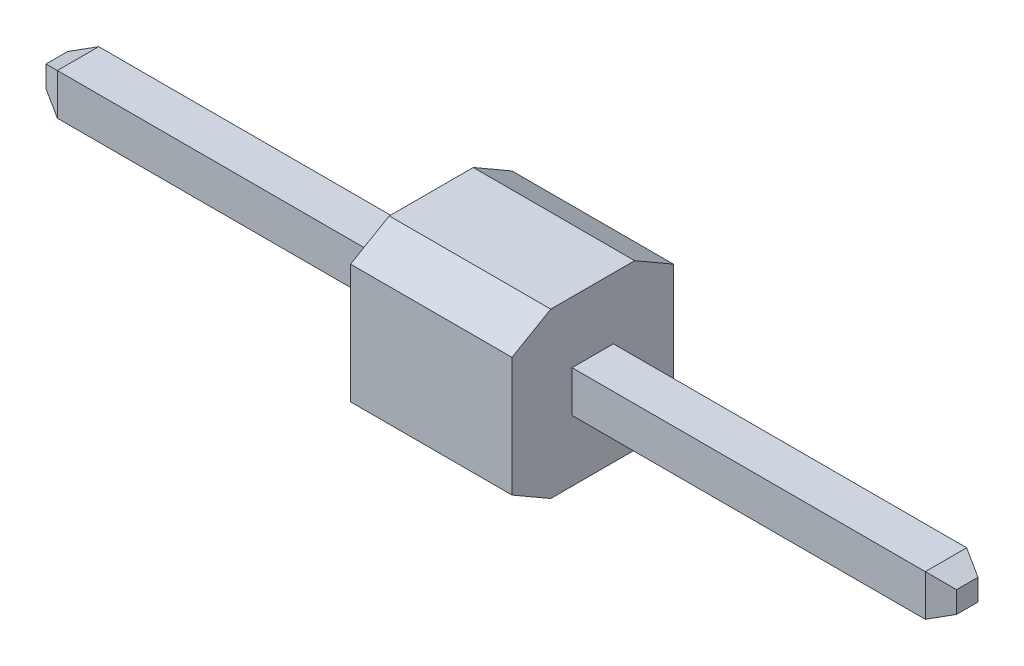
ISO-10303-21;
HEADER;
FILE_DESCRIPTION(('STEP AP214'),'2;1');
FILE_NAME('part.step','',(''),(''),'','','');
FILE_SCHEMA(('AUTOMOTIVE_DESIGN { 1 0 10303 214 1 1 1 1 }'));
ENDSEC;
DATA;
#1=APPLICATION_CONTEXT('core data for automotive mechanical design processes');
#2=APPLICATION_PROTOCOL_DEFINITION('international standard','automotive_design',2000,#1);
#3=PRODUCT_CONTEXT('',#1,'mechanical');
#4=PRODUCT('Part','Part','',(#3));
#5=PRODUCT_RELATED_PRODUCT_CATEGORY('part','',(#4));
#6=PRODUCT_DEFINITION_FORMATION('','',#4);
#7=PRODUCT_DEFINITION_CONTEXT('part definition',#1,'design');
#8=PRODUCT_DEFINITION('design','',#6,#7);
#9=PRODUCT_DEFINITION_SHAPE('','',#8);
#10=(LENGTH_UNIT() NAMED_UNIT(*) SI_UNIT(.MILLI.,.METRE.));
#11=(NAMED_UNIT(*) PLANE_ANGLE_UNIT() SI_UNIT($,.RADIAN.));
#12=(NAMED_UNIT(*) SI_UNIT($,.STERADIAN.) SOLID_ANGLE_UNIT());
#13=UNCERTAINTY_MEASURE_WITH_UNIT(LENGTH_MEASURE(1.E-05),#10,'distance_accuracy_value','');
#14=(GEOMETRIC_REPRESENTATION_CONTEXT(3) GLOBAL_UNCERTAINTY_ASSIGNED_CONTEXT((#13)) GLOBAL_UNIT_ASSIGNED_CONTEXT((#10,
#11,#12)) REPRESENTATION_CONTEXT('',''));
#15=CARTESIAN_POINT('',(0.,0.,0.));
#16=DIRECTION('',(0.,0.,1.));
#17=DIRECTION('',(1.,0.,0.));
#18=AXIS2_PLACEMENT_3D('',#15,#16,#17);
#19=CARTESIAN_POINT('',(5.42107516759986,-5.3971215871937,0.629998634255617));
#20=DIRECTION('',(1.,4.37113882867379E-08,-4.37113882867379E-08));
#21=DIRECTION('',(-4.37113882867379E-08,1.,0.));
#22=AXIS2_PLACEMENT_3D('',#19,#20,#21);
#23=PLANE('',#22);
#24=DIRECTION('',(1.59994777304464E-08,0.500000000000191,0.866025403784328));
#25=VECTOR('',#24,1.);
#26=CARTESIAN_POINT('',(5.42107504461394,-4.1535317487037,-0.940001365744382));
#27=LINE('',#26,#25);
#28=CARTESIAN_POINT('',(5.42107504461394,-4.1535317487037,-0.940001365744382));
#29=VERTEX_POINT('',#28);
#30=CARTESIAN_POINT('',(5.42107505569871,-3.8071215871937,-0.340001365744383));
#31=VERTEX_POINT('',#30);
#32=EDGE_CURVE('E11',#29,#31,#27,.T.);
#33=ORIENTED_EDGE('',*,*,#32,.T.);
#34=DIRECTION('',(4.37113886966664E-08,0.,0.999999999999999));
#35=VECTOR('',#34,1.);
#36=CARTESIAN_POINT('',(5.42107505569871,-3.8071215871937,-0.340001365744383));
#37=LINE('',#36,#35);
#38=CARTESIAN_POINT('',(5.42107511252351,-3.8071215871937,0.959998634255618));
#39=VERTEX_POINT('',#38);
#40=EDGE_CURVE('E304',#31,#39,#37,.T.);
#41=ORIENTED_EDGE('',*,*,#40,.T.);
#42=DIRECTION('',(5.97108668825762E-08,-0.500000000000186,0.866025403784329));
#43=VECTOR('',#42,1.);
#44=CARTESIAN_POINT('',(5.42107511252351,-3.8071215871937,0.959998634255618));
#45=LINE('',#44,#43);
#46=CARTESIAN_POINT('',(5.42107515389241,-4.15353174870369,1.55999863425562));
#47=VERTEX_POINT('',#46);
#48=EDGE_CURVE('E296',#39,#47,#45,.T.);
#49=ORIENTED_EDGE('',*,*,#48,.T.);
#50=DIRECTION('',(4.37113884815545E-08,-0.999999999999999,0.));
#51=VECTOR('',#50,1.);
#52=CARTESIAN_POINT('',(5.42107515389241,-4.15353174870369,1.55999863425562));
#53=LINE('',#52,#51);
#54=CARTESIAN_POINT('',(5.4210752346352,-6.00071142567369,1.55999863425562));
#55=VERTEX_POINT('',#54);
#56=EDGE_CURVE('E281',#47,#55,#53,.T.);
#57=ORIENTED_EDGE('',*,*,#56,.T.);
#58=DIRECTION('',(1.5999479012306E-08,0.500000000000191,0.866025403784328));
#59=VECTOR('',#58,1.);
#60=CARTESIAN_POINT('',(5.42107522355044,-6.3471215871937,0.959998634255618));
#61=LINE('',#60,#59);
#62=CARTESIAN_POINT('',(5.42107522355044,-6.3471215871937,0.959998634255618));
#63=VERTEX_POINT('',#62);
#64=EDGE_CURVE('E265',#63,#55,#61,.T.);
#65=ORIENTED_EDGE('',*,*,#64,.F.);
#66=DIRECTION('',(4.37113886966664E-08,0.,0.999999999999999));
#67=VECTOR('',#66,1.);
#68=CARTESIAN_POINT('',(5.42107516672563,-6.3471215871937,-0.340001365744383));
#69=LINE('',#68,#67);
#70=CARTESIAN_POINT('',(5.42107516672563,-6.3471215871937,-0.340001365744383));
#71=VERTEX_POINT('',#70);
#72=EDGE_CURVE('E248',#71,#63,#69,.T.);
#73=ORIENTED_EDGE('',*,*,#72,.F.);
#74=DIRECTION('',(5.97108656001698E-08,-0.50000000000019,0.866025403784327));
#75=VECTOR('',#74,1.);
#76=CARTESIAN_POINT('',(5.42107512535673,-6.0007114256737,-0.940001365744382));
#77=LINE('',#76,#75);
#78=CARTESIAN_POINT('',(5.42107512535673,-6.0007114256737,-0.940001365744382));
#79=VERTEX_POINT('',#78);
#80=EDGE_CURVE('E242',#79,#71,#77,.T.);
#81=ORIENTED_EDGE('',*,*,#80,.F.);
#82=DIRECTION('',(4.37113884815545E-08,-0.999999999999999,0.));
#83=VECTOR('',#82,1.);
#84=CARTESIAN_POINT('',(5.42107504461394,-4.1535317487037,-0.940001365744382));
#85=LINE('',#84,#83);
#86=EDGE_CURVE('E236',#29,#79,#85,.T.);
#87=ORIENTED_EDGE('',*,*,#86,.F.);
#88=EDGE_LOOP('',(#33,#41,#49,#57,#65,#73,#81,#87));
#89=FACE_BOUND('',#88,.T.);
#90=DIRECTION('',(-4.37113872875372E-08,0.,-0.999999999999999));
#91=VECTOR('',#90,1.);
#92=CARTESIAN_POINT('',(5.42107513962457,-4.7571215871937,0.629998634255617));
#93=LINE('',#92,#91);
#94=CARTESIAN_POINT('',(5.42107513962457,-4.7571215871937,0.629998634255617));
#95=VERTEX_POINT('',#94);
#96=CARTESIAN_POINT('',(5.42107511164928,-4.7571215871937,-0.0100013657443826));
#97=VERTEX_POINT('',#96);
#98=EDGE_CURVE('E302',#95,#97,#93,.T.);
#99=ORIENTED_EDGE('',*,*,#98,.T.);
#100=DIRECTION('',(-4.37113872875371E-08,0.999999999999999,0.));
#101=VECTOR('',#100,1.);
#102=CARTESIAN_POINT('',(5.42107513962457,-5.3971215871937,-0.0100013657443826));
#103=LINE('',#102,#101);
#104=CARTESIAN_POINT('',(5.42107513962457,-5.3971215871937,-0.0100013657443826));
#105=VERTEX_POINT('',#104);
#106=EDGE_CURVE('E293',#105,#97,#103,.T.);
#107=ORIENTED_EDGE('',*,*,#106,.F.);
#108=DIRECTION('',(-4.37113900630947E-08,0.,-0.999999999999999));
#109=VECTOR('',#108,1.);
#110=CARTESIAN_POINT('',(5.42107516759986,-5.3971215871937,0.629998634255617));
#111=LINE('',#110,#109);
#112=CARTESIAN_POINT('',(5.42107516759986,-5.3971215871937,0.629998634255617));
#113=VERTEX_POINT('',#112);
#114=EDGE_CURVE('E278',#113,#105,#111,.T.);
#115=ORIENTED_EDGE('',*,*,#114,.F.);
#116=DIRECTION('',(-4.37113900630947E-08,0.999999999999999,0.));
#117=VECTOR('',#116,1.);
#118=CARTESIAN_POINT('',(5.42107516759986,-5.3971215871937,0.629998634255617));
#119=LINE('',#118,#117);
#120=EDGE_CURVE('E263',#113,#95,#119,.T.);
#121=ORIENTED_EDGE('',*,*,#120,.T.);
#122=EDGE_LOOP('',(#99,#107,#115,#121));
#123=FACE_BOUND('',#122,.T.);
#124=ADVANCED_FACE('F17',(#89,#123),#23,.T.);
#125=CARTESIAN_POINT('',(2.92107516759986,-5.39712169647217,0.629998743534088));
#126=DIRECTION('',(1.,4.37113882867379E-08,-4.37113882867379E-08));
#127=DIRECTION('',(-4.37113882867379E-08,1.,0.));
#128=AXIS2_PLACEMENT_3D('',#125,#126,#127);
#129=PLANE('',#128);
#130=DIRECTION('',(1.59994783714339E-08,0.500000000000191,0.866025403784328));
#131=VECTOR('',#130,1.);
#132=CARTESIAN_POINT('',(2.92107504461394,-4.15353185798217,-0.940001256465912));
#133=LINE('',#132,#131);
#134=CARTESIAN_POINT('',(2.92107504461394,-4.15353185798217,-0.940001256465912));
#135=VERTEX_POINT('',#134);
#136=CARTESIAN_POINT('',(2.92107505569871,-3.80712169647217,-0.340001256465912));
#137=VERTEX_POINT('',#136);
#138=EDGE_CURVE('E24',#135,#137,#133,.T.);
#139=ORIENTED_EDGE('',*,*,#138,.F.);
#140=DIRECTION('',(4.37113882411397E-08,-0.999999999999999,0.));
#141=VECTOR('',#140,1.);
#142=CARTESIAN_POINT('',(2.92107504461394,-4.15353185798217,-0.940001256465912));
#143=LINE('',#142,#141);
#144=CARTESIAN_POINT('',(2.92107512535673,-6.00071153495217,-0.940001256465912));
#145=VERTEX_POINT('',#144);
#146=EDGE_CURVE('E300',#135,#145,#143,.T.);
#147=ORIENTED_EDGE('',*,*,#146,.T.);
#148=DIRECTION('',(5.97108668821449E-08,-0.50000000000019,0.866025403784327));
#149=VECTOR('',#148,1.);
#150=CARTESIAN_POINT('',(2.92107512535673,-6.00071153495217,-0.940001256465912));
#151=LINE('',#150,#149);
#152=CARTESIAN_POINT('',(2.92107516672563,-6.34712169647217,-0.340001256465912));
#153=VERTEX_POINT('',#152);
#154=EDGE_CURVE('E286',#145,#153,#151,.T.);
#155=ORIENTED_EDGE('',*,*,#154,.T.);
#156=DIRECTION('',(4.37113883550593E-08,0.,0.999999999999999));
#157=VECTOR('',#156,1.);
#158=CARTESIAN_POINT('',(2.92107516672563,-6.34712169647217,-0.340001256465912));
#159=LINE('',#158,#157);
#160=CARTESIAN_POINT('',(2.92107522355044,-6.34712169647217,0.959998743534088));
#161=VERTEX_POINT('',#160);
#162=EDGE_CURVE('E271',#153,#161,#159,.T.);
#163=ORIENTED_EDGE('',*,*,#162,.T.);
#164=DIRECTION('',(1.59994783713184E-08,0.500000000000191,0.866025403784328));
#165=VECTOR('',#164,1.);
#166=CARTESIAN_POINT('',(2.92107522355044,-6.34712169647217,0.959998743534088));
#167=LINE('',#166,#165);
#168=CARTESIAN_POINT('',(2.9210752346352,-6.00071153495216,1.55999874353409));
#169=VERTEX_POINT('',#168);
#170=EDGE_CURVE('E253',#161,#169,#167,.T.);
#171=ORIENTED_EDGE('',*,*,#170,.T.);
#172=DIRECTION('',(4.37113882411397E-08,-0.999999999999999,0.));
#173=VECTOR('',#172,1.);
#174=CARTESIAN_POINT('',(2.92107515389241,-4.15353185798216,1.55999874353409));
#175=LINE('',#174,#173);
#176=CARTESIAN_POINT('',(2.92107515389241,-4.15353185798216,1.55999874353409));
#177=VERTEX_POINT('',#176);
#178=EDGE_CURVE('E261',#177,#169,#175,.T.);
#179=ORIENTED_EDGE('',*,*,#178,.F.);
#180=DIRECTION('',(5.97108668825762E-08,-0.500000000000186,0.866025403784329));
#181=VECTOR('',#180,1.);
#182=CARTESIAN_POINT('',(2.92107511252351,-3.80712169647217,0.959998743534088));
#183=LINE('',#182,#181);
#184=CARTESIAN_POINT('',(2.92107511252351,-3.80712169647217,0.959998743534088));
#185=VERTEX_POINT('',#184);
#186=EDGE_CURVE('E276',#185,#177,#183,.T.);
#187=ORIENTED_EDGE('',*,*,#186,.F.);
#188=DIRECTION('',(4.37113883550593E-08,0.,0.999999999999999));
#189=VECTOR('',#188,1.);
#190=CARTESIAN_POINT('',(2.92107505569871,-3.80712169647217,-0.340001256465912));
#191=LINE('',#190,#189);
#192=EDGE_CURVE('E291',#137,#185,#191,.T.);
#193=ORIENTED_EDGE('',*,*,#192,.F.);
#194=EDGE_LOOP('',(#139,#147,#155,#163,#171,#179,#187,#193));
#195=FACE_BOUND('',#194,.T.);
#196=DIRECTION('',(-4.37113879814265E-08,0.999999999999999,0.));
#197=VECTOR('',#196,1.);
#198=CARTESIAN_POINT('',(2.92107513962457,-5.39712169647217,-0.0100012564659119));
#199=LINE('',#198,#197);
#200=CARTESIAN_POINT('',(2.92107513962457,-5.39712169647217,-0.0100012564659119));
#201=VERTEX_POINT('',#200);
#202=CARTESIAN_POINT('',(2.92107511164928,-4.75712169647217,-0.0100012564659119));
#203=VERTEX_POINT('',#202);
#204=EDGE_CURVE('E298',#201,#203,#199,.T.);
#205=ORIENTED_EDGE('',*,*,#204,.T.);
#206=DIRECTION('',(-4.37113879814266E-08,0.,-0.999999999999999));
#207=VECTOR('',#206,1.);
#208=CARTESIAN_POINT('',(2.92107513962457,-4.75712169647217,0.629998743534088));
#209=LINE('',#208,#207);
#210=CARTESIAN_POINT('',(2.92107513962457,-4.75712169647217,0.629998743534088));
#211=VERTEX_POINT('',#210);
#212=EDGE_CURVE('E283',#211,#203,#209,.T.);
#213=ORIENTED_EDGE('',*,*,#212,.F.);
#214=DIRECTION('',(-4.37113886753159E-08,0.999999999999999,0.));
#215=VECTOR('',#214,1.);
#216=CARTESIAN_POINT('',(2.92107516759986,-5.39712169647217,0.629998743534088));
#217=LINE('',#216,#215);
#218=CARTESIAN_POINT('',(2.92107516759986,-5.39712169647217,0.629998743534088));
#219=VERTEX_POINT('',#218);
#220=EDGE_CURVE('E268',#219,#211,#217,.T.);
#221=ORIENTED_EDGE('',*,*,#220,.F.);
#222=DIRECTION('',(-4.37113886753159E-08,0.,-0.999999999999999));
#223=VECTOR('',#222,1.);
#224=CARTESIAN_POINT('',(2.92107516759986,-5.39712169647217,0.629998743534088));
#225=LINE('',#224,#223);
#226=EDGE_CURVE('E251',#219,#201,#225,.T.);
#227=ORIENTED_EDGE('',*,*,#226,.T.);
#228=EDGE_LOOP('',(#205,#213,#221,#227));
#229=FACE_BOUND('',#228,.T.);
#230=ADVANCED_FACE('F314',(#195,#229),#129,.F.);
#231=CARTESIAN_POINT('',(5.42107504461394,-4.1535317487037,-0.940001365744382));
#232=DIRECTION('',(5.97108668343731E-08,-0.866025403784328,0.50000000000019));
#233=DIRECTION('',(-1.59994785476185E-08,-0.500000000000192,-0.866025403784329));
#234=AXIS2_PLACEMENT_3D('',#231,#232,#233);
#235=PLANE('',#234);
#236=ORIENTED_EDGE('',*,*,#138,.T.);
#237=DIRECTION('',(-0.999999999999998,-4.37113868656524E-08,4.37113883755557E-08));
#238=VECTOR('',#237,1.);
#239=CARTESIAN_POINT('',(5.42107505569871,-3.8071215871937,-0.340001365744383));
#240=LINE('',#239,#238);
#241=EDGE_CURVE('E288',#31,#137,#240,.T.);
#242=ORIENTED_EDGE('',*,*,#241,.F.);
#243=ORIENTED_EDGE('',*,*,#32,.F.);
#244=DIRECTION('',(-0.999999999999998,-4.37113868656524E-08,4.37113881091022E-08));
#245=VECTOR('',#244,1.);
#246=CARTESIAN_POINT('',(5.42107504461394,-4.1535317487037,-0.940001365744382));
#247=LINE('',#246,#245);
#248=EDGE_CURVE('E256',#29,#135,#247,.T.);
#249=ORIENTED_EDGE('',*,*,#248,.T.);
#250=EDGE_LOOP('',(#236,#242,#243,#249));
#251=FACE_BOUND('',#250,.T.);
#252=ADVANCED_FACE('F306',(#251),#235,.F.);
#253=CARTESIAN_POINT('',(5.42107505569871,-3.8071215871937,-0.340001365744383));
#254=DIRECTION('',(4.37113882867379E-08,-1.,0.));
#255=DIRECTION('',(1.,4.37113882867379E-08,-4.37113882867379E-08));
#256=AXIS2_PLACEMENT_3D('',#253,#254,#255);
#257=PLANE('',#256);
#258=ORIENTED_EDGE('',*,*,#192,.T.);
#259=DIRECTION('',(-0.999999999999998,-4.37113868656524E-08,4.37113882867378E-08));
#260=VECTOR('',#259,1.);
#261=CARTESIAN_POINT('',(5.42107511252351,-3.8071215871937,0.959998634255618));
#262=LINE('',#261,#260);
#263=EDGE_CURVE('E273',#39,#185,#262,.T.);
#264=ORIENTED_EDGE('',*,*,#263,.F.);
#265=ORIENTED_EDGE('',*,*,#40,.F.);
#266=ORIENTED_EDGE('',*,*,#241,.T.);
#267=EDGE_LOOP('',(#258,#264,#265,#266));
#268=FACE_BOUND('',#267,.T.);
#269=ADVANCED_FACE('F311',(#268),#257,.F.);
#270=CARTESIAN_POINT('',(5.42107511252351,-3.8071215871937,0.959998634255618));
#271=DIRECTION('',(1.59994785476185E-08,-0.86602540378433,-0.50000000000019));
#272=DIRECTION('',(-5.97108668343731E-08,0.500000000000188,-0.866025403784329));
#273=AXIS2_PLACEMENT_3D('',#270,#271,#272);
#274=PLANE('',#273);
#275=ORIENTED_EDGE('',*,*,#186,.T.);
#276=DIRECTION('',(-0.999999999999998,-4.37113868656524E-08,4.37113882867378E-08));
#277=VECTOR('',#276,1.);
#278=CARTESIAN_POINT('',(5.42107515389241,-4.15353174870369,1.55999863425562));
#279=LINE('',#278,#277);
#280=EDGE_CURVE('E258',#47,#177,#279,.T.);
#281=ORIENTED_EDGE('',*,*,#280,.F.);
#282=ORIENTED_EDGE('',*,*,#48,.F.);
#283=ORIENTED_EDGE('',*,*,#263,.T.);
#284=EDGE_LOOP('',(#275,#281,#282,#283));
#285=FACE_BOUND('',#284,.T.);
#286=ADVANCED_FACE('F319',(#285),#274,.F.);
#287=CARTESIAN_POINT('',(5.42107515389241,-4.15353174870369,1.55999863425562));
#288=DIRECTION('',(-4.37113882867379E-08,0.,-1.));
#289=DIRECTION('',(-1.,-4.37113882867379E-08,4.37113882867379E-08));
#290=AXIS2_PLACEMENT_3D('',#287,#288,#289);
#291=PLANE('',#290);
#292=ORIENTED_EDGE('',*,*,#178,.T.);
#293=DIRECTION('',(-0.999999999999998,-4.37113868656524E-08,4.37113882867378E-08));
#294=VECTOR('',#293,1.);
#295=CARTESIAN_POINT('',(5.4210752346352,-6.00071142567369,1.55999863425562));
#296=LINE('',#295,#294);
#297=EDGE_CURVE('E245',#55,#169,#296,.T.);
#298=ORIENTED_EDGE('',*,*,#297,.F.);
#299=ORIENTED_EDGE('',*,*,#56,.F.);
#300=ORIENTED_EDGE('',*,*,#280,.T.);
#301=EDGE_LOOP('',(#292,#298,#299,#300));
#302=FACE_BOUND('',#301,.T.);
#303=ADVANCED_FACE('F326',(#302),#291,.F.);
#304=CARTESIAN_POINT('',(5.42107522355044,-6.3471215871937,0.959998634255618));
#305=DIRECTION('',(5.97108668343731E-08,-0.866025403784328,0.50000000000019));
#306=DIRECTION('',(-1.59994785476185E-08,-0.500000000000192,-0.866025403784329));
#307=AXIS2_PLACEMENT_3D('',#304,#305,#306);
#308=PLANE('',#307);
#309=ORIENTED_EDGE('',*,*,#170,.F.);
#310=DIRECTION('',(-0.999999999999998,-4.37113897078233E-08,4.37113882867378E-08));
#311=VECTOR('',#310,1.);
#312=CARTESIAN_POINT('',(5.42107522355044,-6.3471215871937,0.959998634255618));
#313=LINE('',#312,#311);
#314=EDGE_CURVE('E239',#63,#161,#313,.T.);
#315=ORIENTED_EDGE('',*,*,#314,.F.);
#316=ORIENTED_EDGE('',*,*,#64,.T.);
#317=ORIENTED_EDGE('',*,*,#297,.T.);
#318=EDGE_LOOP('',(#309,#315,#316,#317));
#319=FACE_BOUND('',#318,.T.);
#320=ADVANCED_FACE('F329',(#319),#308,.T.);
#321=CARTESIAN_POINT('',(5.42107516672563,-6.3471215871937,-0.340001365744383));
#322=DIRECTION('',(4.37113882867379E-08,-1.,0.));
#323=DIRECTION('',(1.,4.37113882867379E-08,-4.37113882867379E-08));
#324=AXIS2_PLACEMENT_3D('',#321,#322,#323);
#325=PLANE('',#324);
#326=ORIENTED_EDGE('',*,*,#162,.F.);
#327=DIRECTION('',(-0.999999999999998,-4.37113897078233E-08,4.37113883755557E-08));
#328=VECTOR('',#327,1.);
#329=CARTESIAN_POINT('',(5.42107516672563,-6.3471215871937,-0.340001365744383));
#330=LINE('',#329,#328);
#331=EDGE_CURVE('E233',#71,#153,#330,.T.);
#332=ORIENTED_EDGE('',*,*,#331,.F.);
#333=ORIENTED_EDGE('',*,*,#72,.T.);
#334=ORIENTED_EDGE('',*,*,#314,.T.);
#335=EDGE_LOOP('',(#326,#332,#333,#334));
#336=FACE_BOUND('',#335,.T.);
#337=ADVANCED_FACE('F333',(#336),#325,.T.);
#338=CARTESIAN_POINT('',(5.42107512535673,-6.0007114256737,-0.940001365744382));
#339=DIRECTION('',(1.59994785476185E-08,-0.86602540378433,-0.50000000000019));
#340=DIRECTION('',(-5.97108668343731E-08,0.500000000000188,-0.866025403784329));
#341=AXIS2_PLACEMENT_3D('',#338,#339,#340);
#342=PLANE('',#341);
#343=ORIENTED_EDGE('',*,*,#154,.F.);
#344=DIRECTION('',(-0.999999999999998,-4.37113868656524E-08,4.37113881091021E-08));
#345=VECTOR('',#344,1.);
#346=CARTESIAN_POINT('',(5.42107512535673,-6.0007114256737,-0.940001365744382));
#347=LINE('',#346,#345);
#348=EDGE_CURVE('E230',#79,#145,#347,.T.);
#349=ORIENTED_EDGE('',*,*,#348,.F.);
#350=ORIENTED_EDGE('',*,*,#80,.T.);
#351=ORIENTED_EDGE('',*,*,#331,.T.);
#352=EDGE_LOOP('',(#343,#349,#350,#351));
#353=FACE_BOUND('',#352,.T.);
#354=ADVANCED_FACE('F337',(#353),#342,.T.);
#355=CARTESIAN_POINT('',(5.42107504461394,-4.1535317487037,-0.940001365744382));
#356=DIRECTION('',(-4.37113882867379E-08,0.,-1.));
#357=DIRECTION('',(-4.37113882867379E-08,1.,0.));
#358=AXIS2_PLACEMENT_3D('',#355,#356,#357);
#359=PLANE('',#358);
#360=ORIENTED_EDGE('',*,*,#146,.F.);
#361=ORIENTED_EDGE('',*,*,#248,.F.);
#362=ORIENTED_EDGE('',*,*,#86,.T.);
#363=ORIENTED_EDGE('',*,*,#348,.T.);
#364=EDGE_LOOP('',(#360,#361,#362,#363));
#365=FACE_BOUND('',#364,.T.);
#366=ADVANCED_FACE('F339',(#365),#359,.T.);
#367=CARTESIAN_POINT('',(-2.87892483240014,-5.39712194999822,0.62999899706014));
#368=DIRECTION('',(-1.,-4.37113882867379E-08,4.37113882867379E-08));
#369=DIRECTION('',(4.37113882867379E-08,-1.,0.));
#370=AXIS2_PLACEMENT_3D('',#367,#368,#369);
#371=PLANE('',#370);
#372=DIRECTION('',(4.37113874024238E-08,-0.999999999999999,0.));
#373=VECTOR('',#372,1.);
#374=CARTESIAN_POINT('',(-2.87892487489797,-4.91100347718822,0.14388052425114));
#375=LINE('',#374,#373);
#376=CARTESIAN_POINT('',(-2.87892487489797,-4.91100347718822,0.14388052425114));
#377=VERTEX_POINT('',#376);
#378=CARTESIAN_POINT('',(-2.87892486037543,-5.24324042279822,0.14388052425114));
#379=VERTEX_POINT('',#378);
#380=EDGE_CURVE('E228',#377,#379,#375,.T.);
#381=ORIENTED_EDGE('',*,*,#380,.T.);
#382=DIRECTION('',(4.37113874013716E-08,0.,0.999999999999999));
#383=VECTOR('',#382,1.);
#384=CARTESIAN_POINT('',(-2.87892486037543,-5.24324042279822,0.14388052425114));
#385=LINE('',#384,#383);
#386=CARTESIAN_POINT('',(-2.87892484585289,-5.24324042279822,0.47611746986914));
#387=VERTEX_POINT('',#386);
#388=EDGE_CURVE('E223',#379,#387,#385,.T.);
#389=ORIENTED_EDGE('',*,*,#388,.T.);
#390=DIRECTION('',(-4.37113900757521E-08,0.999999999999999,0.));
#391=VECTOR('',#390,1.);
#392=CARTESIAN_POINT('',(-2.87892484585289,-5.24324042279822,0.47611746986914));
#393=LINE('',#392,#391);
#394=CARTESIAN_POINT('',(-2.87892486037543,-4.91100347718822,0.47611746986914));
#395=VERTEX_POINT('',#394);
#396=EDGE_CURVE('E215',#387,#395,#393,.T.);
#397=ORIENTED_EDGE('',*,*,#396,.T.);
#398=DIRECTION('',(-4.37113847280434E-08,0.,-0.999999999999999));
#399=VECTOR('',#398,1.);
#400=CARTESIAN_POINT('',(-2.87892486037543,-4.91100347718822,0.47611746986914));
#401=LINE('',#400,#399);
#402=EDGE_CURVE('E207',#395,#377,#401,.T.);
#403=ORIENTED_EDGE('',*,*,#402,.T.);
#404=EDGE_LOOP('',(#381,#389,#397,#403));
#405=FACE_BOUND('',#404,.T.);
#406=ADVANCED_FACE('F341',(#405),#371,.T.);
#407=CARTESIAN_POINT('',(-2.87892483240014,-5.39712194999822,0.62999899706014));
#408=DIRECTION('',(4.37113882867379E-08,-1.,0.));
#409=DIRECTION('',(-4.37113882867379E-08,0.,-1.));
#410=AXIS2_PLACEMENT_3D('',#407,#408,#409);
#411=PLANE('',#410);
#412=DIRECTION('',(0.999999999999998,4.37113881958092E-08,-4.37113882769955E-08));
#413=VECTOR('',#412,1.);
#414=CARTESIAN_POINT('',(-2.54892483240014,-5.39712193557346,0.629998982635382));
#415=LINE('',#414,#413);
#416=CARTESIAN_POINT('',(-2.54892483240014,-5.39712193557346,0.629998982635382));
#417=VERTEX_POINT('',#416);
#418=EDGE_CURVE('E225',#417,#219,#415,.T.);
#419=ORIENTED_EDGE('',*,*,#418,.F.);
#420=DIRECTION('',(-4.37113872875372E-08,0.,-0.999999999999999));
#421=VECTOR('',#420,1.);
#422=CARTESIAN_POINT('',(-2.54892483240014,-5.39712193557346,0.629998982635382));
#423=LINE('',#422,#421);
#424=CARTESIAN_POINT('',(-2.54892486037543,-5.39712193557346,-0.010001017364618));
#425=VERTEX_POINT('',#424);
#426=EDGE_CURVE('E217',#417,#425,#423,.T.);
#427=ORIENTED_EDGE('',*,*,#426,.T.);
#428=DIRECTION('',(0.999999999999998,4.37113881958092E-08,-4.37113882161058E-08));
#429=VECTOR('',#428,1.);
#430=CARTESIAN_POINT('',(-2.54892486037543,-5.39712193557346,-0.010001017364618));
#431=LINE('',#430,#429);
#432=EDGE_CURVE('E220',#425,#201,#431,.T.);
#433=ORIENTED_EDGE('',*,*,#432,.T.);
#434=ORIENTED_EDGE('',*,*,#226,.F.);
#435=EDGE_LOOP('',(#419,#427,#433,#434));
#436=FACE_BOUND('',#435,.T.);
#437=ADVANCED_FACE('F348',(#436),#411,.T.);
#438=CARTESIAN_POINT('',(-2.87892486037543,-5.39712194999822,-0.0100010029398598));
#439=DIRECTION('',(-4.37113882867379E-08,0.,-1.));
#440=DIRECTION('',(-1.,-4.37113882867379E-08,4.37113882867379E-08));
#441=AXIS2_PLACEMENT_3D('',#438,#439,#440);
#442=PLANE('',#441);
#443=ORIENTED_EDGE('',*,*,#432,.F.);
#444=DIRECTION('',(-4.37113886753159E-08,0.999999999999999,0.));
#445=VECTOR('',#444,1.);
#446=CARTESIAN_POINT('',(-2.54892486037543,-5.39712193557346,-0.010001017364618));
#447=LINE('',#446,#445);
#448=CARTESIAN_POINT('',(-2.54892488835072,-4.75712193557346,-0.010001017364618));
#449=VERTEX_POINT('',#448);
#450=EDGE_CURVE('E209',#425,#449,#447,.T.);
#451=ORIENTED_EDGE('',*,*,#450,.T.);
#452=DIRECTION('',(0.999999999999998,4.37113881958092E-08,-4.37113882161057E-08));
#453=VECTOR('',#452,1.);
#454=CARTESIAN_POINT('',(-2.54892488835072,-4.75712193557346,-0.010001017364618));
#455=LINE('',#454,#453);
#456=EDGE_CURVE('E212',#449,#203,#455,.T.);
#457=ORIENTED_EDGE('',*,*,#456,.T.);
#458=ORIENTED_EDGE('',*,*,#204,.F.);
#459=EDGE_LOOP('',(#443,#451,#457,#458));
#460=FACE_BOUND('',#459,.T.);
#461=ADVANCED_FACE('F424',(#460),#442,.T.);
#462=CARTESIAN_POINT('',(-2.87892486037543,-4.75712194999822,0.62999899706014));
#463=DIRECTION('',(4.37113882867379E-08,-1.,0.));
#464=DIRECTION('',(-4.37113882867379E-08,0.,-1.));
#465=AXIS2_PLACEMENT_3D('',#462,#463,#464);
#466=PLANE('',#465);
#467=ORIENTED_EDGE('',*,*,#456,.F.);
#468=DIRECTION('',(4.37113900630947E-08,0.,0.999999999999999));
#469=VECTOR('',#468,1.);
#470=CARTESIAN_POINT('',(-2.54892488835072,-4.75712193557347,-0.010001017364618));
#471=LINE('',#470,#469);
#472=CARTESIAN_POINT('',(-2.54892486037543,-4.75712193557346,0.629998982635382));
#473=VERTEX_POINT('',#472);
#474=EDGE_CURVE('E201',#449,#473,#471,.T.);
#475=ORIENTED_EDGE('',*,*,#474,.T.);
#476=DIRECTION('',(0.999999999999998,4.37113881958092E-08,-4.37113882769955E-08));
#477=VECTOR('',#476,1.);
#478=CARTESIAN_POINT('',(-2.54892486037543,-4.75712193557346,0.629998982635382));
#479=LINE('',#478,#477);
#480=EDGE_CURVE('E204',#473,#211,#479,.T.);
#481=ORIENTED_EDGE('',*,*,#480,.T.);
#482=ORIENTED_EDGE('',*,*,#212,.T.);
#483=EDGE_LOOP('',(#467,#475,#481,#482));
#484=FACE_BOUND('',#483,.T.);
#485=ADVANCED_FACE('F421',(#484),#466,.F.);
#486=CARTESIAN_POINT('',(-2.87892483240014,-5.39712194999822,0.62999899706014));
#487=DIRECTION('',(-4.37113882867379E-08,0.,-1.));
#488=DIRECTION('',(-1.,-4.37113882867379E-08,4.37113882867379E-08));
#489=AXIS2_PLACEMENT_3D('',#486,#487,#488);
#490=PLANE('',#489);
#491=ORIENTED_EDGE('',*,*,#480,.F.);
#492=DIRECTION('',(4.37113858997583E-08,-0.999999999999999,0.));
#493=VECTOR('',#492,1.);
#494=CARTESIAN_POINT('',(-2.54892486037543,-4.75712193557346,0.629998982635382));
#495=LINE('',#494,#493);
#496=EDGE_CURVE('E196',#473,#417,#495,.T.);
#497=ORIENTED_EDGE('',*,*,#496,.T.);
#498=ORIENTED_EDGE('',*,*,#418,.T.);
#499=ORIENTED_EDGE('',*,*,#220,.T.);
#500=EDGE_LOOP('',(#491,#497,#498,#499));
#501=FACE_BOUND('',#500,.T.);
#502=ADVANCED_FACE('F376',(#501),#490,.F.);
#503=CARTESIAN_POINT('',(-2.87892483240014,-5.39712194999822,0.62999899706014));
#504=DIRECTION('',(-4.37113882867379E-08,0.,-1.));
#505=DIRECTION('',(-1.,-4.37113882867379E-08,4.37113882867379E-08));
#506=AXIS2_PLACEMENT_3D('',#503,#504,#505);
#507=PLANE('',#506);
#508=DIRECTION('',(0.999999999999998,4.37113881958092E-08,-4.37113882769955E-08));
#509=VECTOR('',#508,1.);
#510=CARTESIAN_POINT('',(5.42107516759986,-5.3971215871937,0.629998634255617));
#511=LINE('',#510,#509);
#512=CARTESIAN_POINT('',(10.8910751675999,-5.39712134809241,0.629998395154324));
#513=VERTEX_POINT('',#512);
#514=EDGE_CURVE('E199',#113,#513,#511,.T.);
#515=ORIENTED_EDGE('',*,*,#514,.T.);
#516=DIRECTION('',(-4.37113872875371E-08,0.999999999999999,0.));
#517=VECTOR('',#516,1.);
#518=CARTESIAN_POINT('',(10.8910751675999,-5.39712134809241,0.629998395154324));
#519=LINE('',#518,#517);
#520=CARTESIAN_POINT('',(10.8910751396246,-4.7571213480924,0.629998395154324));
#521=VERTEX_POINT('',#520);
#522=EDGE_CURVE('E191',#513,#521,#519,.T.);
#523=ORIENTED_EDGE('',*,*,#522,.T.);
#524=DIRECTION('',(0.999999999999998,4.37113933917341E-08,-4.37113882769955E-08));
#525=VECTOR('',#524,1.);
#526=CARTESIAN_POINT('',(5.42107513962457,-4.75712158719371,0.629998634255617));
#527=LINE('',#526,#525);
#528=EDGE_CURVE('E194',#95,#521,#527,.T.);
#529=ORIENTED_EDGE('',*,*,#528,.F.);
#530=ORIENTED_EDGE('',*,*,#120,.F.);
#531=EDGE_LOOP('',(#515,#523,#529,#530));
#532=FACE_BOUND('',#531,.T.);
#533=ADVANCED_FACE('F367',(#532),#507,.F.);
#534=CARTESIAN_POINT('',(-2.87892486037543,-4.75712194999822,0.62999899706014));
#535=DIRECTION('',(4.37113882867379E-08,-1.,0.));
#536=DIRECTION('',(-4.37113882867379E-08,0.,-1.));
#537=AXIS2_PLACEMENT_3D('',#534,#535,#536);
#538=PLANE('',#537);
#539=ORIENTED_EDGE('',*,*,#528,.T.);
#540=DIRECTION('',(-4.37113900630947E-08,0.,-0.999999999999999));
#541=VECTOR('',#540,1.);
#542=CARTESIAN_POINT('',(10.8910751396246,-4.7571213480924,0.629998395154324));
#543=LINE('',#542,#541);
#544=CARTESIAN_POINT('',(10.8910751116493,-4.7571213480924,-0.0100016048456765));
#545=VERTEX_POINT('',#544);
#546=EDGE_CURVE('E186',#521,#545,#543,.T.);
#547=ORIENTED_EDGE('',*,*,#546,.T.);
#548=DIRECTION('',(0.999999999999998,4.37113933917341E-08,-4.37113881146228E-08));
#549=VECTOR('',#548,1.);
#550=CARTESIAN_POINT('',(5.42107511164928,-4.75712158719371,-0.0100013657443823));
#551=LINE('',#550,#549);
#552=EDGE_CURVE('E189',#97,#545,#551,.T.);
#553=ORIENTED_EDGE('',*,*,#552,.F.);
#554=ORIENTED_EDGE('',*,*,#98,.F.);
#555=EDGE_LOOP('',(#539,#547,#553,#554));
#556=FACE_BOUND('',#555,.T.);
#557=ADVANCED_FACE('F364',(#556),#538,.F.);
#558=CARTESIAN_POINT('',(-2.87892486037543,-5.39712194999822,-0.0100010029398598));
#559=DIRECTION('',(-4.37113882867379E-08,0.,-1.));
#560=DIRECTION('',(-1.,-4.37113882867379E-08,4.37113882867379E-08));
#561=AXIS2_PLACEMENT_3D('',#558,#559,#560);
#562=PLANE('',#561);
#563=ORIENTED_EDGE('',*,*,#552,.T.);
#564=DIRECTION('',(4.37113900630947E-08,-0.999999999999999,0.));
#565=VECTOR('',#564,1.);
#566=CARTESIAN_POINT('',(10.8910751116493,-4.7571213480924,-0.0100016048456764));
#567=LINE('',#566,#565);
#568=CARTESIAN_POINT('',(10.8910751396246,-5.39712134809241,-0.0100016048456765));
#569=VERTEX_POINT('',#568);
#570=EDGE_CURVE('E176',#545,#569,#567,.T.);
#571=ORIENTED_EDGE('',*,*,#570,.T.);
#572=DIRECTION('',(0.999999999999998,4.37113881958092E-08,-4.37113881146228E-08));
#573=VECTOR('',#572,1.);
#574=CARTESIAN_POINT('',(5.42107513962457,-5.3971215871937,-0.0100013657443823));
#575=LINE('',#574,#573);
#576=EDGE_CURVE('E179',#105,#569,#575,.T.);
#577=ORIENTED_EDGE('',*,*,#576,.F.);
#578=ORIENTED_EDGE('',*,*,#106,.T.);
#579=EDGE_LOOP('',(#563,#571,#577,#578));
#580=FACE_BOUND('',#579,.T.);
#581=ADVANCED_FACE('F366',(#580),#562,.T.);
#582=CARTESIAN_POINT('',(-2.87892483240014,-5.39712194999822,0.62999899706014));
#583=DIRECTION('',(4.37113882867379E-08,-1.,0.));
#584=DIRECTION('',(-4.37113882867379E-08,0.,-1.));
#585=AXIS2_PLACEMENT_3D('',#582,#583,#584);
#586=PLANE('',#585);
#587=ORIENTED_EDGE('',*,*,#576,.T.);
#588=DIRECTION('',(4.37113872875372E-08,0.,0.999999999999999));
#589=VECTOR('',#588,1.);
#590=CARTESIAN_POINT('',(10.8910751396246,-5.39712134809241,-0.0100016048456765));
#591=LINE('',#590,#589);
#592=EDGE_CURVE('E167',#569,#513,#591,.T.);
#593=ORIENTED_EDGE('',*,*,#592,.T.);
#594=ORIENTED_EDGE('',*,*,#514,.F.);
#595=ORIENTED_EDGE('',*,*,#114,.T.);
#596=EDGE_LOOP('',(#587,#593,#594,#595));
#597=FACE_BOUND('',#596,.T.);
#598=ADVANCED_FACE('F373',(#597),#586,.T.);
#599=CARTESIAN_POINT('',(11.2210751675999,-5.39712133366765,0.629998380729565));
#600=DIRECTION('',(-1.,-4.37113882867379E-08,4.37113882867379E-08));
#601=DIRECTION('',(4.37113882867379E-08,-1.,0.));
#602=AXIS2_PLACEMENT_3D('',#599,#600,#601);
#603=PLANE('',#602);
#604=DIRECTION('',(-4.37113874024238E-08,0.999999999999999,0.));
#605=VECTOR('',#604,1.);
#606=CARTESIAN_POINT('',(11.2210751396246,-5.24323980646765,0.143879907920565));
#607=LINE('',#606,#605);
#608=CARTESIAN_POINT('',(11.2210751396246,-5.24323980646765,0.143879907920565));
#609=VERTEX_POINT('',#608);
#610=CARTESIAN_POINT('',(11.221075125102,-4.91100286085764,0.143879907920565));
#611=VERTEX_POINT('',#610);
#612=EDGE_CURVE('E153',#609,#611,#607,.T.);
#613=ORIENTED_EDGE('',*,*,#612,.T.);
#614=DIRECTION('',(4.37113874013716E-08,0.,0.999999999999999));
#615=VECTOR('',#614,1.);
#616=CARTESIAN_POINT('',(11.221075125102,-4.91100286085765,0.143879907920565));
#617=LINE('',#616,#615);
#618=CARTESIAN_POINT('',(11.2210751396246,-4.91100286085764,0.476116853538565));
#619=VERTEX_POINT('',#618);
#620=EDGE_CURVE('E395',#611,#619,#617,.T.);
#621=ORIENTED_EDGE('',*,*,#620,.T.);
#622=DIRECTION('',(4.37113927490803E-08,-0.999999999999999,0.));
#623=VECTOR('',#622,1.);
#624=CARTESIAN_POINT('',(11.2210751396246,-4.91100286085764,0.476116853538565));
#625=LINE('',#624,#623);
#626=CARTESIAN_POINT('',(11.2210751541471,-5.24323980646765,0.476116853538565));
#627=VERTEX_POINT('',#626);
#628=EDGE_CURVE('E156',#619,#627,#625,.T.);
#629=ORIENTED_EDGE('',*,*,#628,.T.);
#630=DIRECTION('',(-4.37113980946847E-08,0.,-0.999999999999999));
#631=VECTOR('',#630,1.);
#632=CARTESIAN_POINT('',(11.2210751541471,-5.24323980646765,0.476116853538565));
#633=LINE('',#632,#631);
#634=EDGE_CURVE('E149',#627,#609,#633,.T.);
#635=ORIENTED_EDGE('',*,*,#634,.T.);
#636=EDGE_LOOP('',(#613,#621,#629,#635));
#637=FACE_BOUND('',#636,.T.);
#638=ADVANCED_FACE('F151',(#637),#603,.F.);
#639=CARTESIAN_POINT('',(-2.87892485364905,-4.91100347718822,0.62999899706014));
#640=DIRECTION('',(-0.422618301356784,0.906307768563367,1.84732310895534E-08));
#641=DIRECTION('',(4.37113882867379E-08,0.,1.));
#642=AXIS2_PLACEMENT_3D('',#639,#640,#641);
#643=PLANE('',#642);
#644=DIRECTION('',(0.834817095446925,0.389281657126021,-0.389281657126018));
#645=VECTOR('',#644,1.);
#646=CARTESIAN_POINT('',(-2.87892487489798,-4.9110034771877,0.143880524251623));
#647=LINE('',#646,#645);
#648=EDGE_CURVE('E181',#377,#449,#647,.T.);
#649=ORIENTED_EDGE('',*,*,#648,.F.);
#650=ORIENTED_EDGE('',*,*,#402,.F.);
#651=DIRECTION('',(-0.834817129479003,-0.389281657126029,-0.389281584143985));
#652=VECTOR('',#651,1.);
#653=CARTESIAN_POINT('',(-2.54892486037586,-4.75712193557199,0.629998982634844));
#654=LINE('',#653,#652);
#655=EDGE_CURVE('E404',#473,#395,#654,.T.);
#656=ORIENTED_EDGE('',*,*,#655,.F.);
#657=ORIENTED_EDGE('',*,*,#474,.F.);
#658=EDGE_LOOP('',(#649,#650,#656,#657));
#659=FACE_BOUND('',#658,.T.);
#660=ADVANCED_FACE('F418',(#659),#643,.T.);
#661=CARTESIAN_POINT('',(-2.87892483912651,-5.39712194999822,0.47611746986914));
#662=DIRECTION('',(-0.422618222124841,-1.84732292043498E-08,0.906307805509828));
#663=DIRECTION('',(4.37113882867379E-08,-1.,0.));
#664=AXIS2_PLACEMENT_3D('',#661,#662,#663);
#665=PLANE('',#664);
#666=ORIENTED_EDGE('',*,*,#655,.T.);
#667=ORIENTED_EDGE('',*,*,#396,.F.);
#668=DIRECTION('',(-0.83481716351109,0.389281584143977,-0.389281584143989));
#669=VECTOR('',#668,1.);
#670=CARTESIAN_POINT('',(-2.54892483239899,-5.39712193557073,0.629998982635654));
#671=LINE('',#670,#669);
#672=EDGE_CURVE('E160',#417,#387,#671,.T.);
#673=ORIENTED_EDGE('',*,*,#672,.F.);
#674=ORIENTED_EDGE('',*,*,#496,.F.);
#675=EDGE_LOOP('',(#666,#667,#673,#674));
#676=FACE_BOUND('',#675,.T.);
#677=ADVANCED_FACE('F434',(#676),#665,.T.);
#678=CARTESIAN_POINT('',(-2.54892486037543,-5.39712193557346,-0.010001017364618));
#679=DIRECTION('',(0.422618301356784,1.8473232667688E-08,0.906307768563367));
#680=DIRECTION('',(-4.37113882867379E-08,1.,0.));
#681=AXIS2_PLACEMENT_3D('',#678,#679,#680);
#682=PLANE('',#681);
#683=ORIENTED_EDGE('',*,*,#648,.T.);
#684=ORIENTED_EDGE('',*,*,#450,.F.);
#685=DIRECTION('',(0.834817129479008,-0.389281584143985,-0.389281657126018));
#686=VECTOR('',#685,1.);
#687=CARTESIAN_POINT('',(-2.87892486037826,-5.24324042280576,0.1438805242526));
#688=LINE('',#687,#686);
#689=EDGE_CURVE('E170',#379,#425,#688,.T.);
#690=ORIENTED_EDGE('',*,*,#689,.F.);
#691=ORIENTED_EDGE('',*,*,#380,.F.);
#692=EDGE_LOOP('',(#683,#684,#690,#691));
#693=FACE_BOUND('',#692,.T.);
#694=ADVANCED_FACE('F413',(#693),#682,.F.);
#695=CARTESIAN_POINT('',(-2.54892483240014,-5.39712193557346,0.629998982635382));
#696=DIRECTION('',(0.422618222124841,0.906307805509828,-1.84732308250282E-08));
#697=DIRECTION('',(-4.37113882867379E-08,0.,-1.));
#698=AXIS2_PLACEMENT_3D('',#695,#696,#697);
#699=PLANE('',#698);
#700=ORIENTED_EDGE('',*,*,#672,.T.);
#701=ORIENTED_EDGE('',*,*,#388,.F.);
#702=ORIENTED_EDGE('',*,*,#689,.T.);
#703=ORIENTED_EDGE('',*,*,#426,.F.);
#704=EDGE_LOOP('',(#700,#701,#702,#703));
#705=FACE_BOUND('',#704,.T.);
#706=ADVANCED_FACE('F429',(#705),#699,.F.);
#707=CARTESIAN_POINT('',(11.2210751608735,-5.24323980646765,0.629998380729565));
#708=DIRECTION('',(0.422618301356784,-0.906307768563367,-1.84732310470096E-08));
#709=DIRECTION('',(4.37113882867379E-08,0.,1.));
#710=AXIS2_PLACEMENT_3D('',#707,#708,#709);
#711=PLANE('',#710);
#712=DIRECTION('',(-0.834817129479005,-0.389281657126024,-0.389281584143985));
#713=VECTOR('',#712,1.);
#714=CARTESIAN_POINT('',(11.2210751396246,-5.24323980646816,0.143879907921048));
#715=LINE('',#714,#713);
#716=EDGE_CURVE('E164',#609,#569,#715,.T.);
#717=ORIENTED_EDGE('',*,*,#716,.F.);
#718=ORIENTED_EDGE('',*,*,#634,.F.);
#719=DIRECTION('',(0.834817095446925,0.389281657126023,-0.389281657126017));
#720=VECTOR('',#719,1.);
#721=CARTESIAN_POINT('',(10.8910751675999,-5.39712134809241,0.629998395154324));
#722=LINE('',#721,#720);
#723=EDGE_CURVE('E392',#513,#627,#722,.T.);
#724=ORIENTED_EDGE('',*,*,#723,.F.);
#725=ORIENTED_EDGE('',*,*,#592,.F.);
#726=EDGE_LOOP('',(#717,#718,#724,#725));
#727=FACE_BOUND('',#726,.T.);
#728=ADVANCED_FACE('F165',(#727),#711,.T.);
#729=CARTESIAN_POINT('',(10.8910751675999,-5.39712134809241,0.629998395154324));
#730=DIRECTION('',(-0.422618301356784,-1.8473232667688E-08,-0.906307768563367));
#731=DIRECTION('',(-4.37113882867379E-08,1.,0.));
#732=AXIS2_PLACEMENT_3D('',#729,#730,#731);
#733=PLANE('',#732);
#734=ORIENTED_EDGE('',*,*,#723,.T.);
#735=ORIENTED_EDGE('',*,*,#628,.F.);
#736=DIRECTION('',(0.834817129479008,-0.389281584143983,-0.389281657126021));
#737=VECTOR('',#736,1.);
#738=CARTESIAN_POINT('',(10.8910751396261,-4.7571213480882,0.629998395153421));
#739=LINE('',#738,#737);
#740=EDGE_CURVE('E389',#521,#619,#739,.T.);
#741=ORIENTED_EDGE('',*,*,#740,.F.);
#742=ORIENTED_EDGE('',*,*,#522,.F.);
#743=EDGE_LOOP('',(#734,#735,#741,#742));
#744=FACE_BOUND('',#743,.T.);
#745=ADVANCED_FACE('F390',(#744),#733,.F.);
#746=CARTESIAN_POINT('',(11.2210751463509,-5.39712133366765,0.143879907920565));
#747=DIRECTION('',(0.422618222124841,1.84732292043498E-08,-0.906307805509828));
#748=DIRECTION('',(4.37113882867379E-08,-1.,0.));
#749=AXIS2_PLACEMENT_3D('',#746,#747,#748);
#750=PLANE('',#749);
#751=ORIENTED_EDGE('',*,*,#716,.T.);
#752=ORIENTED_EDGE('',*,*,#570,.F.);
#753=DIRECTION('',(-0.834817163511088,0.389281584143981,-0.389281584143988));
#754=VECTOR('',#753,1.);
#755=CARTESIAN_POINT('',(11.2210751251021,-4.91100286085712,0.143879907921048));
#756=LINE('',#755,#754);
#757=EDGE_CURVE('E175',#611,#545,#756,.T.);
#758=ORIENTED_EDGE('',*,*,#757,.F.);
#759=ORIENTED_EDGE('',*,*,#612,.F.);
#760=EDGE_LOOP('',(#751,#752,#758,#759));
#761=FACE_BOUND('',#760,.T.);
#762=ADVANCED_FACE('F173',(#761),#750,.T.);
#763=CARTESIAN_POINT('',(10.8910751396246,-4.7571213480924,0.629998395154324));
#764=DIRECTION('',(-0.422618222124841,-0.906307805509828,1.84732307824844E-08));
#765=DIRECTION('',(-4.37113882867379E-08,0.,-1.));
#766=AXIS2_PLACEMENT_3D('',#763,#764,#765);
#767=PLANE('',#766);
#768=ORIENTED_EDGE('',*,*,#740,.T.);
#769=ORIENTED_EDGE('',*,*,#620,.F.);
#770=ORIENTED_EDGE('',*,*,#757,.T.);
#771=ORIENTED_EDGE('',*,*,#546,.F.);
#772=EDGE_LOOP('',(#768,#769,#770,#771));
#773=FACE_BOUND('',#772,.T.);
#774=ADVANCED_FACE('F394',(#773),#767,.F.);
#775=CLOSED_SHELL('',(#124,#230,#252,#269,#286,#303,#320,#337,#354,#366,#406,#437,#461,#485,
#502,#533,#557,#581,#598,#638,#660,#677,#694,#706,#728,#745,#762,#774));
#776=MANIFOLD_SOLID_BREP('B1',#775);
#777=ADVANCED_BREP_SHAPE_REPRESENTATION('',(#18,#776),#14);
#778=SHAPE_DEFINITION_REPRESENTATION(#9,#777);
ENDSEC;
END-ISO-10303-21;
